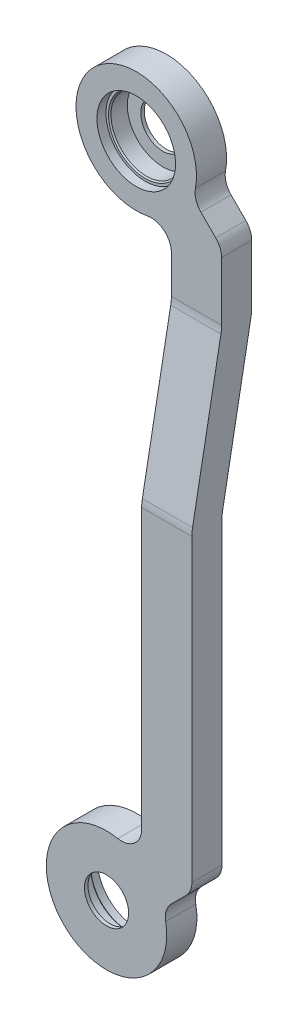
ISO-10303-21;
HEADER;
FILE_DESCRIPTION(('STEP AP214'),'2;1');
FILE_NAME('part.step','',(''),(''),'','','');
FILE_SCHEMA(('AUTOMOTIVE_DESIGN { 1 0 10303 214 1 1 1 1 }'));
ENDSEC;
DATA;
#1=APPLICATION_CONTEXT('core data for automotive mechanical design processes');
#2=APPLICATION_PROTOCOL_DEFINITION('international standard','automotive_design',2000,#1);
#3=PRODUCT_CONTEXT('',#1,'mechanical');
#4=PRODUCT('Part','Part','',(#3));
#5=PRODUCT_RELATED_PRODUCT_CATEGORY('part','',(#4));
#6=PRODUCT_DEFINITION_FORMATION('','',#4);
#7=PRODUCT_DEFINITION_CONTEXT('part definition',#1,'design');
#8=PRODUCT_DEFINITION('design','',#6,#7);
#9=PRODUCT_DEFINITION_SHAPE('','',#8);
#10=(LENGTH_UNIT() NAMED_UNIT(*) SI_UNIT(.MILLI.,.METRE.));
#11=(NAMED_UNIT(*) PLANE_ANGLE_UNIT() SI_UNIT($,.RADIAN.));
#12=(NAMED_UNIT(*) SI_UNIT($,.STERADIAN.) SOLID_ANGLE_UNIT());
#13=UNCERTAINTY_MEASURE_WITH_UNIT(LENGTH_MEASURE(1.E-05),#10,'distance_accuracy_value','');
#14=(GEOMETRIC_REPRESENTATION_CONTEXT(3) GLOBAL_UNCERTAINTY_ASSIGNED_CONTEXT((#13)) GLOBAL_UNIT_ASSIGNED_CONTEXT((#10,
#11,#12)) REPRESENTATION_CONTEXT('',''));
#15=CARTESIAN_POINT('',(0.,0.,0.));
#16=DIRECTION('',(0.,0.,1.));
#17=DIRECTION('',(1.,0.,0.));
#18=AXIS2_PLACEMENT_3D('',#15,#16,#17);
#19=CARTESIAN_POINT('',(0.,203.2,9.52499999999999));
#20=DIRECTION('',(0.,0.,1.));
#21=DIRECTION('',(1.,0.,0.));
#22=AXIS2_PLACEMENT_3D('',#19,#20,#21);
#23=CYLINDRICAL_SURFACE('',#22,6.985);
#24=CARTESIAN_POINT('',(0.,203.2,-9.39799999999998));
#25=DIRECTION('',(0.,0.,1.));
#26=DIRECTION('',(1.,0.,0.));
#27=AXIS2_PLACEMENT_3D('',#24,#25,#26);
#28=CIRCLE('',#27,6.985);
#29=CARTESIAN_POINT('',(6.985,203.2,-9.39799999999998));
#30=VERTEX_POINT('',#29);
#31=EDGE_CURVE('E506',#30,#30,#28,.T.);
#32=ORIENTED_EDGE('',*,*,#31,.F.);
#33=EDGE_LOOP('',(#32));
#34=FACE_BOUND('',#33,.T.);
#35=CARTESIAN_POINT('',(0.,203.2,-8.28674999999995));
#36=DIRECTION('',(0.,0.,1.));
#37=DIRECTION('',(1.,0.,0.));
#38=AXIS2_PLACEMENT_3D('',#35,#36,#37);
#39=CIRCLE('',#38,6.985);
#40=CARTESIAN_POINT('',(6.985,203.2,-8.28674999999995));
#41=VERTEX_POINT('',#40);
#42=EDGE_CURVE('E441',#41,#41,#39,.F.);
#43=ORIENTED_EDGE('',*,*,#42,.F.);
#44=EDGE_LOOP('',(#43));
#45=FACE_BOUND('',#44,.T.);
#46=ADVANCED_FACE('F44',(#34,#45),#23,.F.);
#47=CARTESIAN_POINT('',(0.,0.,9.52499999999999));
#48=DIRECTION('',(0.,0.,1.));
#49=DIRECTION('',(1.,0.,0.));
#50=AXIS2_PLACEMENT_3D('',#47,#48,#49);
#51=CYLINDRICAL_SURFACE('',#50,6.985);
#52=CARTESIAN_POINT('',(0.,0.,9.52499999999999));
#53=DIRECTION('',(0.,0.,1.));
#54=DIRECTION('',(1.,0.,0.));
#55=AXIS2_PLACEMENT_3D('',#52,#53,#54);
#56=CIRCLE('',#55,6.985);
#57=CARTESIAN_POINT('',(6.985,0.,9.52499999999999));
#58=VERTEX_POINT('',#57);
#59=EDGE_CURVE('E445',#58,#58,#56,.T.);
#60=ORIENTED_EDGE('',*,*,#59,.T.);
#61=EDGE_LOOP('',(#60));
#62=FACE_BOUND('',#61,.T.);
#63=CARTESIAN_POINT('',(0.,0.,8.41375));
#64=DIRECTION('',(0.,0.,-1.));
#65=DIRECTION('',(-1.,0.,0.));
#66=AXIS2_PLACEMENT_3D('',#63,#64,#65);
#67=CIRCLE('',#66,6.985);
#68=CARTESIAN_POINT('',(-6.985,0.,8.41375));
#69=VERTEX_POINT('',#68);
#70=EDGE_CURVE('E437',#69,#69,#67,.F.);
#71=ORIENTED_EDGE('',*,*,#70,.F.);
#72=EDGE_LOOP('',(#71));
#73=FACE_BOUND('',#72,.T.);
#74=ADVANCED_FACE('F626',(#62,#73),#51,.F.);
#75=CARTESIAN_POINT('',(0.,203.2,63.5));
#76=DIRECTION('',(0.,0.,-1.));
#77=DIRECTION('',(-1.,0.,0.));
#78=AXIS2_PLACEMENT_3D('',#75,#76,#77);
#79=CYLINDRICAL_SURFACE('',#78,19.05);
#80=CARTESIAN_POINT('',(0.,203.2,-9.39799999999996));
#81=DIRECTION('',(0.,0.,-1.));
#82=DIRECTION('',(0.,1.,0.));
#83=AXIS2_PLACEMENT_3D('',#80,#81,#82);
#84=CIRCLE('',#83,19.05);
#85=CARTESIAN_POINT('',(3.56018596316735,184.485631832529,-9.39799999999997));
#86=VERTEX_POINT('',#85);
#87=CARTESIAN_POINT('',(18.7143681674714,199.639814036833,-9.39799999999996));
#88=VERTEX_POINT('',#87);
#89=EDGE_CURVE('E374',#86,#88,#84,.T.);
#90=ORIENTED_EDGE('',*,*,#89,.F.);
#91=DIRECTION('',(0.,0.,-1.));
#92=VECTOR('',#91,1.);
#93=CARTESIAN_POINT('',(3.56018596316735,184.485631832529,63.5));
#94=LINE('',#93,#92);
#95=CARTESIAN_POINT('',(3.56018596316735,184.485631832529,0.127000000000044));
#96=VERTEX_POINT('',#95);
#97=EDGE_CURVE('E305',#86,#96,#94,.F.);
#98=ORIENTED_EDGE('',*,*,#97,.T.);
#99=CARTESIAN_POINT('',(0.,203.2,0.127000000000044));
#100=DIRECTION('',(0.,0.,1.));
#101=DIRECTION('',(1.,0.,0.));
#102=AXIS2_PLACEMENT_3D('',#99,#100,#101);
#103=CIRCLE('',#102,19.05);
#104=CARTESIAN_POINT('',(18.7143681674714,199.639814036833,0.127000000000044));
#105=VERTEX_POINT('',#104);
#106=EDGE_CURVE('E359',#105,#96,#103,.T.);
#107=ORIENTED_EDGE('',*,*,#106,.F.);
#108=DIRECTION('',(0.,0.,-1.));
#109=VECTOR('',#108,1.);
#110=CARTESIAN_POINT('',(18.7143681674714,199.639814036833,63.5));
#111=LINE('',#110,#109);
#112=EDGE_CURVE('E301',#105,#88,#111,.T.);
#113=ORIENTED_EDGE('',*,*,#112,.T.);
#114=EDGE_LOOP('',(#90,#98,#107,#113));
#115=FACE_BOUND('',#114,.T.);
#116=ADVANCED_FACE('F377',(#115),#79,.T.);
#117=CARTESIAN_POINT('',(6.63271851688673,185.341961331777,63.5));
#118=DIRECTION('',(0.707106781186544,0.707106781186551,0.));
#119=DIRECTION('',(-0.707106781186551,0.707106781186544,0.));
#120=AXIS2_PLACEMENT_3D('',#117,#118,#119);
#121=PLANE('',#120);
#122=DIRECTION('',(-0.707106781186551,0.707106781186544,0.));
#123=VECTOR('',#122,1.);
#124=CARTESIAN_POINT('',(6.63271851688672,185.341961331777,-9.39799999999998));
#125=LINE('',#124,#123);
#126=CARTESIAN_POINT('',(9.25262806053454,182.722051788129,-9.39799999999998));
#127=VERTEX_POINT('',#126);
#128=CARTESIAN_POINT('',(9.23704267809101,182.737637170573,-9.39799999999998));
#129=VERTEX_POINT('',#128);
#130=EDGE_CURVE('E375',#127,#129,#125,.T.);
#131=ORIENTED_EDGE('',*,*,#130,.F.);
#132=DIRECTION('',(0.,0.,-1.));
#133=VECTOR('',#132,1.);
#134=CARTESIAN_POINT('',(9.25262806053455,182.722051788129,0.127000000000044));
#135=LINE('',#134,#133);
#136=CARTESIAN_POINT('',(9.25262806053455,182.722051788129,0.127000000000044));
#137=VERTEX_POINT('',#136);
#138=EDGE_CURVE('E298',#127,#137,#135,.F.);
#139=ORIENTED_EDGE('',*,*,#138,.T.);
#140=DIRECTION('',(0.707106781186551,-0.707106781186544,0.));
#141=VECTOR('',#140,1.);
#142=CARTESIAN_POINT('',(6.63271851688673,185.341961331777,0.127000000000044));
#143=LINE('',#142,#141);
#144=CARTESIAN_POINT('',(9.23704267809101,182.737637170573,0.127000000000044));
#145=VERTEX_POINT('',#144);
#146=EDGE_CURVE('E356',#145,#137,#143,.T.);
#147=ORIENTED_EDGE('',*,*,#146,.F.);
#148=DIRECTION('',(0.,0.,1.));
#149=VECTOR('',#148,1.);
#150=CARTESIAN_POINT('',(9.23704267809101,182.737637170573,-9.39799999999996));
#151=LINE('',#150,#149);
#152=EDGE_CURVE('E294',#145,#129,#151,.F.);
#153=ORIENTED_EDGE('',*,*,#152,.T.);
#154=EDGE_LOOP('',(#131,#139,#147,#153));
#155=FACE_BOUND('',#154,.T.);
#156=ADVANCED_FACE('F365',(#155),#121,.F.);
#157=CARTESIAN_POINT('',(11.1125,180.862179848664,63.5));
#158=DIRECTION('',(1.,0.,0.));
#159=DIRECTION('',(0.,1.,0.));
#160=AXIS2_PLACEMENT_3D('',#157,#158,#159);
#161=PLANE('',#160);
#162=DIRECTION('',(0.,1.,0.));
#163=VECTOR('',#162,1.);
#164=CARTESIAN_POINT('',(11.1125,180.862179848664,0.));
#165=LINE('',#164,#163);
#166=CARTESIAN_POINT('',(11.1125,24.9680762724054,0.));
#167=VERTEX_POINT('',#166);
#168=CARTESIAN_POINT('',(11.1125,113.135133042531,0.));
#169=VERTEX_POINT('',#168);
#170=EDGE_CURVE('E233',#167,#169,#165,.T.);
#171=ORIENTED_EDGE('',*,*,#170,.F.);
#172=DIRECTION('',(0.,0.,-1.));
#173=VECTOR('',#172,1.);
#174=CARTESIAN_POINT('',(11.1125,24.9680762724054,9.52499999999999));
#175=LINE('',#174,#173);
#176=CARTESIAN_POINT('',(11.1125,24.9680762724054,9.525));
#177=VERTEX_POINT('',#176);
#178=EDGE_CURVE('E291',#167,#177,#175,.F.);
#179=ORIENTED_EDGE('',*,*,#178,.T.);
#180=DIRECTION('',(0.,-1.,0.));
#181=VECTOR('',#180,1.);
#182=CARTESIAN_POINT('',(11.1125,180.862179848664,9.52500000000003));
#183=LINE('',#182,#181);
#184=CARTESIAN_POINT('',(11.1125,113.135133042531,9.52500000000002));
#185=VERTEX_POINT('',#184);
#186=EDGE_CURVE('E427',#185,#177,#183,.T.);
#187=ORIENTED_EDGE('',*,*,#186,.F.);
#188=CARTESIAN_POINT('',(11.1125,113.135133042531,-3.17499999999998));
#189=DIRECTION('',(1.,0.,0.));
#190=DIRECTION('',(0.,1.,0.));
#191=AXIS2_PLACEMENT_3D('',#188,#189,#190);
#192=CIRCLE('',#191,12.7);
#193=CARTESIAN_POINT('',(11.1125,115.445430677591,9.31309532464575));
#194=VERTEX_POINT('',#193);
#195=EDGE_CURVE('E458',#185,#194,#192,.F.);
#196=ORIENTED_EDGE('',*,*,#195,.T.);
#197=DIRECTION('',(0.,-0.98331459249179,0.181913199610981));
#198=VECTOR('',#197,1.);
#199=CARTESIAN_POINT('',(11.1125,169.004541902066,-0.595340251882098));
#200=LINE('',#199,#198);
#201=CARTESIAN_POINT('',(11.1125,163.954569322409,0.338904675354306));
#202=VERTEX_POINT('',#201);
#203=EDGE_CURVE('E232',#202,#194,#200,.T.);
#204=ORIENTED_EDGE('',*,*,#203,.F.);
#205=CARTESIAN_POINT('',(11.1125,166.264866957469,12.827));
#206=DIRECTION('',(1.,0.,0.));
#207=DIRECTION('',(0.,1.,0.));
#208=AXIS2_PLACEMENT_3D('',#205,#206,#207);
#209=CIRCLE('',#208,12.7);
#210=CARTESIAN_POINT('',(11.1125,166.264866957469,0.127000000000044));
#211=VERTEX_POINT('',#210);
#212=EDGE_CURVE('E244',#202,#211,#209,.T.);
#213=ORIENTED_EDGE('',*,*,#212,.T.);
#214=DIRECTION('',(0.,-1.,0.));
#215=VECTOR('',#214,1.);
#216=CARTESIAN_POINT('',(11.1125,180.862179848664,0.127000000000044));
#217=LINE('',#216,#215);
#218=CARTESIAN_POINT('',(11.1125,178.231923727595,0.127000000000044));
#219=VERTEX_POINT('',#218);
#220=EDGE_CURVE('E369',#219,#211,#217,.T.);
#221=ORIENTED_EDGE('',*,*,#220,.F.);
#222=DIRECTION('',(0.,0.,-1.));
#223=VECTOR('',#222,1.);
#224=CARTESIAN_POINT('',(11.1125,178.231923727595,-9.39799999999998));
#225=LINE('',#224,#223);
#226=CARTESIAN_POINT('',(11.1125,178.231923727595,-9.39799999999998));
#227=VERTEX_POINT('',#226);
#228=EDGE_CURVE('E287',#219,#227,#225,.T.);
#229=ORIENTED_EDGE('',*,*,#228,.T.);
#230=DIRECTION('',(0.,1.,0.));
#231=VECTOR('',#230,1.);
#232=CARTESIAN_POINT('',(11.1125,180.862179848664,-9.39799999999998));
#233=LINE('',#232,#231);
#234=CARTESIAN_POINT('',(11.1125,166.264866957469,-9.39799999999998));
#235=VERTEX_POINT('',#234);
#236=EDGE_CURVE('E384',#235,#227,#233,.T.);
#237=ORIENTED_EDGE('',*,*,#236,.F.);
#238=CARTESIAN_POINT('',(11.1125,166.264866957469,3.30200000000003));
#239=DIRECTION('',(1.,0.,0.));
#240=DIRECTION('',(0.,1.,0.));
#241=AXIS2_PLACEMENT_3D('',#238,#239,#240);
#242=CIRCLE('',#241,12.7);
#243=CARTESIAN_POINT('',(11.1125,163.954569322409,-9.1860953246457));
#244=VERTEX_POINT('',#243);
#245=EDGE_CURVE('E230',#235,#244,#242,.F.);
#246=ORIENTED_EDGE('',*,*,#245,.T.);
#247=DIRECTION('',(0.,0.98331459249179,-0.181913199610981));
#248=VECTOR('',#247,1.);
#249=CARTESIAN_POINT('',(11.1125,167.300729868901,-9.80513502574659));
#250=LINE('',#249,#248);
#251=CARTESIAN_POINT('',(11.1125,115.445430677591,-0.211904675354252));
#252=VERTEX_POINT('',#251);
#253=EDGE_CURVE('E211',#252,#244,#250,.T.);
#254=ORIENTED_EDGE('',*,*,#253,.F.);
#255=CARTESIAN_POINT('',(11.1125,113.135133042531,-12.7));
#256=DIRECTION('',(1.,0.,0.));
#257=DIRECTION('',(0.,1.,0.));
#258=AXIS2_PLACEMENT_3D('',#255,#256,#257);
#259=CIRCLE('',#258,12.7);
#260=EDGE_CURVE('E226',#252,#169,#259,.T.);
#261=ORIENTED_EDGE('',*,*,#260,.T.);
#262=EDGE_LOOP('',(#171,#179,#187,#196,#204,#213,#221,#229,#237,#246,#254,#261));
#263=FACE_BOUND('',#262,.T.);
#264=ADVANCED_FACE('F225',(#263),#161,.F.);
#265=CARTESIAN_POINT('',(11.1125,22.3378201513362,63.5));
#266=DIRECTION('',(0.707106781186543,-0.707106781186552,0.));
#267=DIRECTION('',(0.707106781186552,0.707106781186543,0.));
#268=AXIS2_PLACEMENT_3D('',#265,#266,#267);
#269=PLANE('',#268);
#270=DIRECTION('',(0.707106781186552,0.707106781186543,0.));
#271=VECTOR('',#270,1.);
#272=CARTESIAN_POINT('',(11.1125,22.3378201513362,0.));
#273=LINE('',#272,#271);
#274=CARTESIAN_POINT('',(9.23704267809101,20.4623628294272,0.));
#275=VERTEX_POINT('',#274);
#276=CARTESIAN_POINT('',(9.25262806053457,20.4779482118708,0.));
#277=VERTEX_POINT('',#276);
#278=EDGE_CURVE('E406',#275,#277,#273,.T.);
#279=ORIENTED_EDGE('',*,*,#278,.F.);
#280=DIRECTION('',(0.,0.,1.));
#281=VECTOR('',#280,1.);
#282=CARTESIAN_POINT('',(9.23704267809101,20.4623628294272,9.525));
#283=LINE('',#282,#281);
#284=CARTESIAN_POINT('',(9.23704267809101,20.4623628294272,9.52499999999999));
#285=VERTEX_POINT('',#284);
#286=EDGE_CURVE('E284',#275,#285,#283,.T.);
#287=ORIENTED_EDGE('',*,*,#286,.T.);
#288=DIRECTION('',(-0.707106781186552,-0.707106781186543,0.));
#289=VECTOR('',#288,1.);
#290=CARTESIAN_POINT('',(11.1125,22.3378201513362,9.52499999999999));
#291=LINE('',#290,#289);
#292=CARTESIAN_POINT('',(9.25262806053457,20.4779482118708,9.52499999999999));
#293=VERTEX_POINT('',#292);
#294=EDGE_CURVE('E423',#293,#285,#291,.T.);
#295=ORIENTED_EDGE('',*,*,#294,.F.);
#296=DIRECTION('',(0.,0.,-1.));
#297=VECTOR('',#296,1.);
#298=CARTESIAN_POINT('',(9.25262806053457,20.4779482118708,0.));
#299=LINE('',#298,#297);
#300=EDGE_CURVE('E280',#293,#277,#299,.T.);
#301=ORIENTED_EDGE('',*,*,#300,.T.);
#302=EDGE_LOOP('',(#279,#287,#295,#301));
#303=FACE_BOUND('',#302,.T.);
#304=ADVANCED_FACE('F595',(#303),#269,.F.);
#305=CARTESIAN_POINT('',(0.,0.,63.5));
#306=DIRECTION('',(0.,0.,-1.));
#307=DIRECTION('',(-1.,0.,0.));
#308=AXIS2_PLACEMENT_3D('',#305,#306,#307);
#309=CYLINDRICAL_SURFACE('',#308,19.05);
#310=CARTESIAN_POINT('',(0.,0.,0.));
#311=DIRECTION('',(0.,0.,-1.));
#312=DIRECTION('',(-1.,0.,0.));
#313=AXIS2_PLACEMENT_3D('',#310,#311,#312);
#314=CIRCLE('',#313,19.05);
#315=CARTESIAN_POINT('',(18.7143681674714,3.56018596316709,0.));
#316=VERTEX_POINT('',#315);
#317=CARTESIAN_POINT('',(3.56018596316735,18.7143681674714,0.));
#318=VERTEX_POINT('',#317);
#319=EDGE_CURVE('E402',#316,#318,#314,.T.);
#320=ORIENTED_EDGE('',*,*,#319,.F.);
#321=DIRECTION('',(0.,0.,-1.));
#322=VECTOR('',#321,1.);
#323=CARTESIAN_POINT('',(18.7143681674714,3.56018596316709,63.5));
#324=LINE('',#323,#322);
#325=CARTESIAN_POINT('',(18.7143681674714,3.56018596316709,9.52499999999999));
#326=VERTEX_POINT('',#325);
#327=EDGE_CURVE('E277',#316,#326,#324,.F.);
#328=ORIENTED_EDGE('',*,*,#327,.T.);
#329=CARTESIAN_POINT('',(0.,0.,9.52499999999999));
#330=DIRECTION('',(0.,0.,1.));
#331=DIRECTION('',(0.,-1.,0.));
#332=AXIS2_PLACEMENT_3D('',#329,#330,#331);
#333=CIRCLE('',#332,19.05);
#334=CARTESIAN_POINT('',(3.56018596316735,18.7143681674714,9.525));
#335=VERTEX_POINT('',#334);
#336=EDGE_CURVE('E419',#335,#326,#333,.T.);
#337=ORIENTED_EDGE('',*,*,#336,.F.);
#338=DIRECTION('',(0.,0.,-1.));
#339=VECTOR('',#338,1.);
#340=CARTESIAN_POINT('',(3.56018596316735,18.7143681674714,63.5));
#341=LINE('',#340,#339);
#342=EDGE_CURVE('E273',#335,#318,#341,.T.);
#343=ORIENTED_EDGE('',*,*,#342,.T.);
#344=EDGE_LOOP('',(#320,#328,#337,#343));
#345=FACE_BOUND('',#344,.T.);
#346=ADVANCED_FACE('F587',(#345),#309,.T.);
#347=CARTESIAN_POINT('',(26.9875,15.7621798486633,63.5));
#348=DIRECTION('',(-0.707106781186543,0.707106781186552,0.));
#349=DIRECTION('',(-0.707106781186552,-0.707106781186543,0.));
#350=AXIS2_PLACEMENT_3D('',#347,#348,#349);
#351=PLANE('',#350);
#352=DIRECTION('',(-0.707106781186552,-0.707106781186543,0.));
#353=VECTOR('',#352,1.);
#354=CARTESIAN_POINT('',(26.9875,15.7621798486633,0.));
#355=LINE('',#354,#353);
#356=CARTESIAN_POINT('',(25.1276280605346,13.9023079091978,0.));
#357=VERTEX_POINT('',#356);
#358=CARTESIAN_POINT('',(20.4623628294274,9.23704267809072,0.));
#359=VERTEX_POINT('',#358);
#360=EDGE_CURVE('E398',#357,#359,#355,.T.);
#361=ORIENTED_EDGE('',*,*,#360,.F.);
#362=DIRECTION('',(0.,0.,-1.));
#363=VECTOR('',#362,1.);
#364=CARTESIAN_POINT('',(25.1276280605346,13.9023079091978,63.5));
#365=LINE('',#364,#363);
#366=CARTESIAN_POINT('',(25.1276280605346,13.9023079091978,9.52499999999999));
#367=VERTEX_POINT('',#366);
#368=EDGE_CURVE('E267',#357,#367,#365,.F.);
#369=ORIENTED_EDGE('',*,*,#368,.T.);
#370=DIRECTION('',(0.707106781186552,0.707106781186543,0.));
#371=VECTOR('',#370,1.);
#372=CARTESIAN_POINT('',(26.9875,15.7621798486633,9.52499999999999));
#373=LINE('',#372,#371);
#374=CARTESIAN_POINT('',(20.4623628294274,9.23704267809072,9.52499999999999));
#375=VERTEX_POINT('',#374);
#376=EDGE_CURVE('E415',#375,#367,#373,.T.);
#377=ORIENTED_EDGE('',*,*,#376,.F.);
#378=DIRECTION('',(0.,0.,1.));
#379=VECTOR('',#378,1.);
#380=CARTESIAN_POINT('',(20.4623628294274,9.23704267809072,0.));
#381=LINE('',#380,#379);
#382=EDGE_CURVE('E263',#375,#359,#381,.F.);
#383=ORIENTED_EDGE('',*,*,#382,.T.);
#384=EDGE_LOOP('',(#361,#369,#377,#383));
#385=FACE_BOUND('',#384,.T.);
#386=ADVANCED_FACE('F576',(#385),#351,.F.);
#387=CARTESIAN_POINT('',(26.9875,15.7621798486633,63.5));
#388=DIRECTION('',(-1.,0.,0.));
#389=DIRECTION('',(0.,-1.,0.));
#390=AXIS2_PLACEMENT_3D('',#387,#388,#389);
#391=PLANE('',#390);
#392=DIRECTION('',(0.,-1.,0.));
#393=VECTOR('',#392,1.);
#394=CARTESIAN_POINT('',(26.9875,-19.05,9.52499999999998));
#395=LINE('',#394,#393);
#396=CARTESIAN_POINT('',(26.9875,113.135133042531,9.52500000000002));
#397=VERTEX_POINT('',#396);
#398=CARTESIAN_POINT('',(26.9875,18.3924359697325,9.52499999999999));
#399=VERTEX_POINT('',#398);
#400=EDGE_CURVE('E380',#397,#399,#395,.T.);
#401=ORIENTED_EDGE('',*,*,#400,.T.);
#402=DIRECTION('',(0.,0.,-1.));
#403=VECTOR('',#402,1.);
#404=CARTESIAN_POINT('',(26.9875,18.3924359697325,63.5));
#405=LINE('',#404,#403);
#406=CARTESIAN_POINT('',(26.9875,18.3924359697325,0.));
#407=VERTEX_POINT('',#406);
#408=EDGE_CURVE('E256',#399,#407,#405,.T.);
#409=ORIENTED_EDGE('',*,*,#408,.T.);
#410=DIRECTION('',(0.,1.,0.));
#411=VECTOR('',#410,1.);
#412=CARTESIAN_POINT('',(26.9875,114.3,0.));
#413=LINE('',#412,#411);
#414=CARTESIAN_POINT('',(26.9875,113.135133042531,0.));
#415=VERTEX_POINT('',#414);
#416=EDGE_CURVE('E503',#407,#415,#413,.T.);
#417=ORIENTED_EDGE('',*,*,#416,.T.);
#418=CARTESIAN_POINT('',(26.9875,113.135133042531,-12.7));
#419=DIRECTION('',(-1.,0.,0.));
#420=DIRECTION('',(0.,-1.,0.));
#421=AXIS2_PLACEMENT_3D('',#418,#419,#420);
#422=CIRCLE('',#421,12.7);
#423=CARTESIAN_POINT('',(26.9875,115.445430677591,-0.211904675354257));
#424=VERTEX_POINT('',#423);
#425=EDGE_CURVE('E240',#415,#424,#422,.T.);
#426=ORIENTED_EDGE('',*,*,#425,.T.);
#427=DIRECTION('',(0.,0.98331459249179,-0.181913199610981));
#428=VECTOR('',#427,1.);
#429=CARTESIAN_POINT('',(26.9875,165.1,-9.39799999999997));
#430=LINE('',#429,#428);
#431=CARTESIAN_POINT('',(26.9875,163.954569322409,-9.18609532464571));
#432=VERTEX_POINT('',#431);
#433=EDGE_CURVE('E214',#424,#432,#430,.T.);
#434=ORIENTED_EDGE('',*,*,#433,.T.);
#435=CARTESIAN_POINT('',(26.9875,166.264866957469,3.30200000000003));
#436=DIRECTION('',(-1.,0.,0.));
#437=DIRECTION('',(0.,-1.,0.));
#438=AXIS2_PLACEMENT_3D('',#435,#436,#437);
#439=CIRCLE('',#438,12.7);
#440=CARTESIAN_POINT('',(26.9875,166.264866957469,-9.39799999999997));
#441=VERTEX_POINT('',#440);
#442=EDGE_CURVE('E452',#432,#441,#439,.F.);
#443=ORIENTED_EDGE('',*,*,#442,.T.);
#444=DIRECTION('',(0.,1.,0.));
#445=VECTOR('',#444,1.);
#446=CARTESIAN_POINT('',(26.9875,222.25,-9.39799999999996));
#447=LINE('',#446,#445);
#448=CARTESIAN_POINT('',(26.9875,184.807564030268,-9.39799999999997));
#449=VERTEX_POINT('',#448);
#450=EDGE_CURVE('E495',#441,#449,#447,.T.);
#451=ORIENTED_EDGE('',*,*,#450,.T.);
#452=DIRECTION('',(0.,0.,-1.));
#453=VECTOR('',#452,1.);
#454=CARTESIAN_POINT('',(26.9875,184.807564030268,63.5));
#455=LINE('',#454,#453);
#456=CARTESIAN_POINT('',(26.9875,184.807564030268,0.127000000000042));
#457=VERTEX_POINT('',#456);
#458=EDGE_CURVE('E253',#449,#457,#455,.F.);
#459=ORIENTED_EDGE('',*,*,#458,.T.);
#460=DIRECTION('',(0.,-1.,0.));
#461=VECTOR('',#460,1.);
#462=CARTESIAN_POINT('',(26.9875,165.1,0.127000000000042));
#463=LINE('',#462,#461);
#464=CARTESIAN_POINT('',(26.9875,166.264866957469,0.127000000000042));
#465=VERTEX_POINT('',#464);
#466=EDGE_CURVE('E477',#457,#465,#463,.T.);
#467=ORIENTED_EDGE('',*,*,#466,.T.);
#468=CARTESIAN_POINT('',(26.9875,166.264866957469,12.827));
#469=DIRECTION('',(-1.,0.,0.));
#470=DIRECTION('',(0.,-1.,0.));
#471=AXIS2_PLACEMENT_3D('',#468,#469,#470);
#472=CIRCLE('',#471,12.7);
#473=CARTESIAN_POINT('',(26.9875,163.954569322409,0.338904675354305));
#474=VERTEX_POINT('',#473);
#475=EDGE_CURVE('E239',#465,#474,#472,.T.);
#476=ORIENTED_EDGE('',*,*,#475,.T.);
#477=DIRECTION('',(0.,-0.98331459249179,0.181913199610981));
#478=VECTOR('',#477,1.);
#479=CARTESIAN_POINT('',(26.9875,114.3,9.52500000000002));
#480=LINE('',#479,#478);
#481=CARTESIAN_POINT('',(26.9875,115.445430677591,9.31309532464575));
#482=VERTEX_POINT('',#481);
#483=EDGE_CURVE('E387',#474,#482,#480,.T.);
#484=ORIENTED_EDGE('',*,*,#483,.T.);
#485=CARTESIAN_POINT('',(26.9875,113.135133042531,-3.17499999999998));
#486=DIRECTION('',(-1.,0.,0.));
#487=DIRECTION('',(0.,-1.,0.));
#488=AXIS2_PLACEMENT_3D('',#485,#486,#487);
#489=CIRCLE('',#488,12.7);
#490=EDGE_CURVE('E449',#482,#397,#489,.F.);
#491=ORIENTED_EDGE('',*,*,#490,.T.);
#492=EDGE_LOOP('',(#401,#409,#417,#426,#434,#443,#451,#459,#467,#476,#484,#491));
#493=FACE_BOUND('',#492,.T.);
#494=ADVANCED_FACE('F488',(#493),#391,.F.);
#495=CARTESIAN_POINT('',(17.8580386682231,196.567281483113,63.5));
#496=DIRECTION('',(-0.707106781186542,-0.707106781186554,0.));
#497=DIRECTION('',(0.707106781186554,-0.707106781186542,0.));
#498=AXIS2_PLACEMENT_3D('',#495,#496,#497);
#499=PLANE('',#498);
#500=DIRECTION('',(0.707106781186554,-0.707106781186542,0.));
#501=VECTOR('',#500,1.);
#502=CARTESIAN_POINT('',(17.8580386682231,196.567281483113,-9.39799999999996));
#503=LINE('',#502,#501);
#504=CARTESIAN_POINT('',(20.4623628294274,193.962957321909,-9.39799999999996));
#505=VERTEX_POINT('',#504);
#506=CARTESIAN_POINT('',(25.1276280605345,189.297692090802,-9.39799999999996));
#507=VERTEX_POINT('',#506);
#508=EDGE_CURVE('E431',#505,#507,#503,.T.);
#509=ORIENTED_EDGE('',*,*,#508,.F.);
#510=DIRECTION('',(0.,0.,1.));
#511=VECTOR('',#510,1.);
#512=CARTESIAN_POINT('',(20.4623628294274,193.962957321909,0.127000000000044));
#513=LINE('',#512,#511);
#514=CARTESIAN_POINT('',(20.4623628294274,193.962957321909,0.127000000000044));
#515=VERTEX_POINT('',#514);
#516=EDGE_CURVE('E311',#505,#515,#513,.T.);
#517=ORIENTED_EDGE('',*,*,#516,.T.);
#518=DIRECTION('',(-0.707106781186554,0.707106781186542,0.));
#519=VECTOR('',#518,1.);
#520=CARTESIAN_POINT('',(17.8580386682231,196.567281483113,0.127000000000044));
#521=LINE('',#520,#519);
#522=CARTESIAN_POINT('',(25.1276280605345,189.297692090802,0.127000000000044));
#523=VERTEX_POINT('',#522);
#524=EDGE_CURVE('E220',#523,#515,#521,.T.);
#525=ORIENTED_EDGE('',*,*,#524,.F.);
#526=DIRECTION('',(0.,0.,-1.));
#527=VECTOR('',#526,1.);
#528=CARTESIAN_POINT('',(25.1276280605345,189.297692090802,63.5));
#529=LINE('',#528,#527);
#530=EDGE_CURVE('E308',#523,#507,#529,.T.);
#531=ORIENTED_EDGE('',*,*,#530,.T.);
#532=EDGE_LOOP('',(#509,#517,#525,#531));
#533=FACE_BOUND('',#532,.T.);
#534=ADVANCED_FACE('F616',(#533),#499,.F.);
#535=CARTESIAN_POINT('',(-19.05,222.25,-9.39799999999996));
#536=DIRECTION('',(0.,0.,-1.));
#537=DIRECTION('',(0.,1.,0.));
#538=AXIS2_PLACEMENT_3D('',#535,#536,#537);
#539=PLANE('',#538);
#540=ORIENTED_EDGE('',*,*,#31,.T.);
#541=EDGE_LOOP('',(#540));
#542=FACE_BOUND('',#541,.T.);
#543=ORIENTED_EDGE('',*,*,#508,.T.);
#544=CARTESIAN_POINT('',(20.6375,184.807564030268,-9.39799999999998));
#545=DIRECTION('',(0.,0.,-1.));
#546=DIRECTION('',(0.,1.,0.));
#547=AXIS2_PLACEMENT_3D('',#544,#545,#546);
#548=CIRCLE('',#547,6.35);
#549=EDGE_CURVE('E60',#507,#449,#548,.T.);
#550=ORIENTED_EDGE('',*,*,#549,.T.);
#551=ORIENTED_EDGE('',*,*,#450,.F.);
#552=DIRECTION('',(1.,0.,0.));
#553=VECTOR('',#552,1.);
#554=CARTESIAN_POINT('',(-19.05,166.264866957469,-9.39799999999997));
#555=LINE('',#554,#553);
#556=EDGE_CURVE('E455',#441,#235,#555,.F.);
#557=ORIENTED_EDGE('',*,*,#556,.T.);
#558=ORIENTED_EDGE('',*,*,#236,.T.);
#559=CARTESIAN_POINT('',(4.7625,178.231923727595,-9.39799999999998));
#560=DIRECTION('',(0.,0.,-1.));
#561=DIRECTION('',(0.,1.,0.));
#562=AXIS2_PLACEMENT_3D('',#559,#560,#561);
#563=CIRCLE('',#562,6.35);
#564=EDGE_CURVE('E337',#227,#127,#563,.F.);
#565=ORIENTED_EDGE('',*,*,#564,.T.);
#566=ORIENTED_EDGE('',*,*,#130,.T.);
#567=CARTESIAN_POINT('',(4.74691461755646,178.247509110038,-9.39799999999998));
#568=DIRECTION('',(0.,0.,-1.));
#569=DIRECTION('',(0.,1.,0.));
#570=AXIS2_PLACEMENT_3D('',#567,#568,#569);
#571=CIRCLE('',#570,6.35);
#572=EDGE_CURVE('E343',#129,#86,#571,.F.);
#573=ORIENTED_EDGE('',*,*,#572,.T.);
#574=ORIENTED_EDGE('',*,*,#89,.T.);
#575=CARTESIAN_POINT('',(24.9524908899619,198.453085382444,-9.39799999999996));
#576=DIRECTION('',(0.,0.,-1.));
#577=DIRECTION('',(0.,1.,0.));
#578=AXIS2_PLACEMENT_3D('',#575,#576,#577);
#579=CIRCLE('',#578,6.35);
#580=EDGE_CURVE('E53',#88,#505,#579,.F.);
#581=ORIENTED_EDGE('',*,*,#580,.T.);
#582=EDGE_LOOP('',(#543,#550,#551,#557,#558,#565,#566,#573,#574,#581));
#583=FACE_BOUND('',#582,.T.);
#584=ADVANCED_FACE('F373',(#542,#583),#539,.T.);
#585=CARTESIAN_POINT('',(-19.05,114.3,0.));
#586=DIRECTION('',(0.,0.,-1.));
#587=DIRECTION('',(-1.,0.,0.));
#588=AXIS2_PLACEMENT_3D('',#585,#586,#587);
#589=PLANE('',#588);
#590=CARTESIAN_POINT('',(0.,0.,0.));
#591=DIRECTION('',(0.,0.,-1.));
#592=DIRECTION('',(0.,1.,0.));
#593=AXIS2_PLACEMENT_3D('',#590,#591,#592);
#594=CIRCLE('',#593,12.430125);
#595=CARTESIAN_POINT('',(0.,12.430125,0.));
#596=VERTEX_POINT('',#595);
#597=EDGE_CURVE('E517',#596,#596,#594,.T.);
#598=ORIENTED_EDGE('',*,*,#597,.F.);
#599=EDGE_LOOP('',(#598));
#600=FACE_BOUND('',#599,.T.);
#601=ORIENTED_EDGE('',*,*,#416,.F.);
#602=CARTESIAN_POINT('',(20.6375,18.3924359697325,0.));
#603=DIRECTION('',(0.,0.,-1.));
#604=DIRECTION('',(-1.,0.,0.));
#605=AXIS2_PLACEMENT_3D('',#602,#603,#604);
#606=CIRCLE('',#605,6.35);
#607=EDGE_CURVE('E260',#407,#357,#606,.T.);
#608=ORIENTED_EDGE('',*,*,#607,.T.);
#609=ORIENTED_EDGE('',*,*,#360,.T.);
#610=CARTESIAN_POINT('',(24.9524908899619,4.74691461755611,0.));
#611=DIRECTION('',(0.,0.,-1.));
#612=DIRECTION('',(-1.,0.,0.));
#613=AXIS2_PLACEMENT_3D('',#610,#611,#612);
#614=CIRCLE('',#613,6.35);
#615=EDGE_CURVE('E319',#359,#316,#614,.F.);
#616=ORIENTED_EDGE('',*,*,#615,.T.);
#617=ORIENTED_EDGE('',*,*,#319,.T.);
#618=CARTESIAN_POINT('',(4.74691461755647,24.9524908899618,0.));
#619=DIRECTION('',(0.,0.,-1.));
#620=DIRECTION('',(-1.,0.,0.));
#621=AXIS2_PLACEMENT_3D('',#618,#619,#620);
#622=CIRCLE('',#621,6.35);
#623=EDGE_CURVE('E325',#318,#275,#622,.F.);
#624=ORIENTED_EDGE('',*,*,#623,.T.);
#625=ORIENTED_EDGE('',*,*,#278,.T.);
#626=CARTESIAN_POINT('',(4.76250000000002,24.9680762724054,0.));
#627=DIRECTION('',(0.,0.,-1.));
#628=DIRECTION('',(-1.,0.,0.));
#629=AXIS2_PLACEMENT_3D('',#626,#627,#628);
#630=CIRCLE('',#629,6.35);
#631=EDGE_CURVE('E331',#277,#167,#630,.F.);
#632=ORIENTED_EDGE('',*,*,#631,.T.);
#633=ORIENTED_EDGE('',*,*,#170,.T.);
#634=DIRECTION('',(1.,0.,0.));
#635=VECTOR('',#634,1.);
#636=CARTESIAN_POINT('',(26.9875,113.135133042531,0.));
#637=LINE('',#636,#635);
#638=EDGE_CURVE('E237',#169,#415,#637,.T.);
#639=ORIENTED_EDGE('',*,*,#638,.T.);
#640=EDGE_LOOP('',(#601,#608,#609,#616,#617,#624,#625,#632,#633,#639));
#641=FACE_BOUND('',#640,.T.);
#642=ADVANCED_FACE('F562',(#600,#641),#589,.T.);
#643=CARTESIAN_POINT('',(-19.05,165.1,-9.39799999999997));
#644=DIRECTION('',(0.,-0.181913199610981,-0.98331459249179));
#645=DIRECTION('',(0.,0.98331459249179,-0.181913199610981));
#646=AXIS2_PLACEMENT_3D('',#643,#644,#645);
#647=PLANE('',#646);
#648=ORIENTED_EDGE('',*,*,#253,.T.);
#649=DIRECTION('',(1.,0.,0.));
#650=VECTOR('',#649,1.);
#651=CARTESIAN_POINT('',(-19.05,163.954569322409,-9.18609532464571));
#652=LINE('',#651,#650);
#653=EDGE_CURVE('E219',#244,#432,#652,.T.);
#654=ORIENTED_EDGE('',*,*,#653,.T.);
#655=ORIENTED_EDGE('',*,*,#433,.F.);
#656=DIRECTION('',(1.,0.,0.));
#657=VECTOR('',#656,1.);
#658=CARTESIAN_POINT('',(11.1125,115.445430677591,-0.211904675354261));
#659=LINE('',#658,#657);
#660=EDGE_CURVE('E207',#424,#252,#659,.F.);
#661=ORIENTED_EDGE('',*,*,#660,.T.);
#662=EDGE_LOOP('',(#648,#654,#655,#661));
#663=FACE_BOUND('',#662,.T.);
#664=ADVANCED_FACE('F209',(#663),#647,.T.);
#665=CARTESIAN_POINT('',(-19.05,-19.05,9.52499999999998));
#666=DIRECTION('',(0.,0.,1.));
#667=DIRECTION('',(0.,-1.,0.));
#668=AXIS2_PLACEMENT_3D('',#665,#666,#667);
#669=PLANE('',#668);
#670=ORIENTED_EDGE('',*,*,#59,.F.);
#671=EDGE_LOOP('',(#670));
#672=FACE_BOUND('',#671,.T.);
#673=ORIENTED_EDGE('',*,*,#376,.T.);
#674=CARTESIAN_POINT('',(20.6375,18.3924359697325,9.52499999999999));
#675=DIRECTION('',(0.,0.,1.));
#676=DIRECTION('',(0.,-1.,0.));
#677=AXIS2_PLACEMENT_3D('',#674,#675,#676);
#678=CIRCLE('',#677,6.35);
#679=EDGE_CURVE('E270',#367,#399,#678,.T.);
#680=ORIENTED_EDGE('',*,*,#679,.T.);
#681=ORIENTED_EDGE('',*,*,#400,.F.);
#682=DIRECTION('',(1.,0.,0.));
#683=VECTOR('',#682,1.);
#684=CARTESIAN_POINT('',(-19.05,113.135133042531,9.52500000000002));
#685=LINE('',#684,#683);
#686=EDGE_CURVE('E470',#397,#185,#685,.F.);
#687=ORIENTED_EDGE('',*,*,#686,.T.);
#688=ORIENTED_EDGE('',*,*,#186,.T.);
#689=CARTESIAN_POINT('',(4.76250000000002,24.9680762724054,9.525));
#690=DIRECTION('',(0.,0.,1.));
#691=DIRECTION('',(0.,-1.,0.));
#692=AXIS2_PLACEMENT_3D('',#689,#690,#691);
#693=CIRCLE('',#692,6.35);
#694=EDGE_CURVE('E334',#177,#293,#693,.F.);
#695=ORIENTED_EDGE('',*,*,#694,.T.);
#696=ORIENTED_EDGE('',*,*,#294,.T.);
#697=CARTESIAN_POINT('',(4.74691461755647,24.9524908899618,9.525));
#698=DIRECTION('',(0.,0.,1.));
#699=DIRECTION('',(0.,-1.,0.));
#700=AXIS2_PLACEMENT_3D('',#697,#698,#699);
#701=CIRCLE('',#700,6.35);
#702=EDGE_CURVE('E328',#285,#335,#701,.F.);
#703=ORIENTED_EDGE('',*,*,#702,.T.);
#704=ORIENTED_EDGE('',*,*,#336,.T.);
#705=CARTESIAN_POINT('',(24.9524908899619,4.74691461755611,9.52499999999999));
#706=DIRECTION('',(0.,0.,1.));
#707=DIRECTION('',(0.,-1.,0.));
#708=AXIS2_PLACEMENT_3D('',#705,#706,#707);
#709=CIRCLE('',#708,6.35);
#710=EDGE_CURVE('E322',#326,#375,#709,.F.);
#711=ORIENTED_EDGE('',*,*,#710,.T.);
#712=EDGE_LOOP('',(#673,#680,#681,#687,#688,#695,#696,#703,#704,#711));
#713=FACE_BOUND('',#712,.T.);
#714=ADVANCED_FACE('F579',(#672,#713),#669,.T.);
#715=CARTESIAN_POINT('',(-19.05,114.3,9.52500000000002));
#716=DIRECTION('',(0.,0.181913199610981,0.98331459249179));
#717=DIRECTION('',(0.,-0.98331459249179,0.181913199610981));
#718=AXIS2_PLACEMENT_3D('',#715,#716,#717);
#719=PLANE('',#718);
#720=ORIENTED_EDGE('',*,*,#203,.T.);
#721=DIRECTION('',(1.,0.,0.));
#722=VECTOR('',#721,1.);
#723=CARTESIAN_POINT('',(-19.05,115.445430677591,9.31309532464575));
#724=LINE('',#723,#722);
#725=EDGE_CURVE('E466',#194,#482,#724,.T.);
#726=ORIENTED_EDGE('',*,*,#725,.T.);
#727=ORIENTED_EDGE('',*,*,#483,.F.);
#728=DIRECTION('',(1.,0.,0.));
#729=VECTOR('',#728,1.);
#730=CARTESIAN_POINT('',(11.1125,163.954569322409,0.338904675354305));
#731=LINE('',#730,#729);
#732=EDGE_CURVE('E463',#474,#202,#731,.F.);
#733=ORIENTED_EDGE('',*,*,#732,.T.);
#734=EDGE_LOOP('',(#720,#726,#727,#733));
#735=FACE_BOUND('',#734,.T.);
#736=ADVANCED_FACE('F490',(#735),#719,.T.);
#737=CARTESIAN_POINT('',(-19.05,165.1,0.127000000000042));
#738=DIRECTION('',(0.,0.,1.));
#739=DIRECTION('',(1.,0.,0.));
#740=AXIS2_PLACEMENT_3D('',#737,#738,#739);
#741=PLANE('',#740);
#742=CARTESIAN_POINT('',(0.,203.2,0.127000000000044));
#743=DIRECTION('',(0.,0.,1.));
#744=DIRECTION('',(0.,-1.,0.));
#745=AXIS2_PLACEMENT_3D('',#742,#743,#744);
#746=CIRCLE('',#745,12.430125);
#747=CARTESIAN_POINT('',(0.,190.769875,0.127000000000044));
#748=VERTEX_POINT('',#747);
#749=EDGE_CURVE('E527',#748,#748,#746,.T.);
#750=ORIENTED_EDGE('',*,*,#749,.F.);
#751=EDGE_LOOP('',(#750));
#752=FACE_BOUND('',#751,.T.);
#753=ORIENTED_EDGE('',*,*,#466,.F.);
#754=CARTESIAN_POINT('',(20.6375,184.807564030268,0.127000000000044));
#755=DIRECTION('',(0.,0.,1.));
#756=DIRECTION('',(1.,0.,0.));
#757=AXIS2_PLACEMENT_3D('',#754,#755,#756);
#758=CIRCLE('',#757,6.35);
#759=EDGE_CURVE('E316',#457,#523,#758,.T.);
#760=ORIENTED_EDGE('',*,*,#759,.T.);
#761=ORIENTED_EDGE('',*,*,#524,.T.);
#762=CARTESIAN_POINT('',(24.9524908899619,198.453085382444,0.127000000000044));
#763=DIRECTION('',(0.,0.,1.));
#764=DIRECTION('',(1.,0.,0.));
#765=AXIS2_PLACEMENT_3D('',#762,#763,#764);
#766=CIRCLE('',#765,6.35);
#767=EDGE_CURVE('E12',#515,#105,#766,.F.);
#768=ORIENTED_EDGE('',*,*,#767,.T.);
#769=ORIENTED_EDGE('',*,*,#106,.T.);
#770=CARTESIAN_POINT('',(4.74691461755646,178.247509110038,0.127000000000044));
#771=DIRECTION('',(0.,0.,1.));
#772=DIRECTION('',(1.,0.,0.));
#773=AXIS2_PLACEMENT_3D('',#770,#771,#772);
#774=CIRCLE('',#773,6.35);
#775=EDGE_CURVE('E346',#96,#145,#774,.F.);
#776=ORIENTED_EDGE('',*,*,#775,.T.);
#777=ORIENTED_EDGE('',*,*,#146,.T.);
#778=CARTESIAN_POINT('',(4.7625,178.231923727595,0.127000000000044));
#779=DIRECTION('',(0.,0.,1.));
#780=DIRECTION('',(1.,0.,0.));
#781=AXIS2_PLACEMENT_3D('',#778,#779,#780);
#782=CIRCLE('',#781,6.35);
#783=EDGE_CURVE('E340',#137,#219,#782,.F.);
#784=ORIENTED_EDGE('',*,*,#783,.T.);
#785=ORIENTED_EDGE('',*,*,#220,.T.);
#786=DIRECTION('',(1.,0.,0.));
#787=VECTOR('',#786,1.);
#788=CARTESIAN_POINT('',(26.9875,166.264866957469,0.127000000000045));
#789=LINE('',#788,#787);
#790=EDGE_CURVE('E246',#211,#465,#789,.T.);
#791=ORIENTED_EDGE('',*,*,#790,.T.);
#792=EDGE_LOOP('',(#753,#760,#761,#768,#769,#776,#777,#784,#785,#791));
#793=FACE_BOUND('',#792,.T.);
#794=ADVANCED_FACE('F355',(#752,#793),#741,.T.);
#795=CARTESIAN_POINT('',(0.,0.,8.41375));
#796=DIRECTION('',(0.,0.,-1.));
#797=DIRECTION('',(0.,1.,0.));
#798=AXIS2_PLACEMENT_3D('',#795,#796,#797);
#799=PLANE('',#798);
#800=CARTESIAN_POINT('',(0.,0.,8.41375));
#801=DIRECTION('',(0.,0.,-1.));
#802=DIRECTION('',(0.,1.,0.));
#803=AXIS2_PLACEMENT_3D('',#800,#801,#802);
#804=CIRCLE('',#803,11.2395);
#805=CARTESIAN_POINT('',(0.,11.2395,8.41375));
#806=VERTEX_POINT('',#805);
#807=EDGE_CURVE('E541',#806,#806,#804,.T.);
#808=ORIENTED_EDGE('',*,*,#807,.T.);
#809=EDGE_LOOP('',(#808));
#810=FACE_BOUND('',#809,.T.);
#811=ORIENTED_EDGE('',*,*,#70,.T.);
#812=EDGE_LOOP('',(#811));
#813=FACE_BOUND('',#812,.T.);
#814=ADVANCED_FACE('F645',(#810,#813),#799,.T.);
#815=CARTESIAN_POINT('',(0.,0.,0.));
#816=DIRECTION('',(0.,0.,1.));
#817=DIRECTION('',(0.,-1.,0.));
#818=AXIS2_PLACEMENT_3D('',#815,#816,#817);
#819=CYLINDRICAL_SURFACE('',#818,11.2395);
#820=CARTESIAN_POINT('',(0.,0.,3.254375));
#821=DIRECTION('',(0.,0.,-1.));
#822=DIRECTION('',(0.,1.,0.));
#823=AXIS2_PLACEMENT_3D('',#820,#821,#822);
#824=CIRCLE('',#823,11.2395);
#825=CARTESIAN_POINT('',(0.,11.2395,3.254375));
#826=VERTEX_POINT('',#825);
#827=EDGE_CURVE('E442',#826,#826,#824,.F.);
#828=ORIENTED_EDGE('',*,*,#827,.F.);
#829=EDGE_LOOP('',(#828));
#830=FACE_BOUND('',#829,.T.);
#831=ORIENTED_EDGE('',*,*,#807,.F.);
#832=EDGE_LOOP('',(#831));
#833=FACE_BOUND('',#832,.T.);
#834=ADVANCED_FACE('F558',(#830,#833),#819,.F.);
#835=CARTESIAN_POINT('',(0.,0.,1.58749999999999));
#836=DIRECTION('',(0.,0.,-1.));
#837=DIRECTION('',(0.,1.,0.));
#838=AXIS2_PLACEMENT_3D('',#835,#836,#837);
#839=CYLINDRICAL_SURFACE('',#838,12.430125);
#840=CARTESIAN_POINT('',(0.,0.,2.85750000000001));
#841=DIRECTION('',(0.,0.,-1.));
#842=DIRECTION('',(0.,1.,0.));
#843=AXIS2_PLACEMENT_3D('',#840,#841,#842);
#844=CIRCLE('',#843,12.430125);
#845=CARTESIAN_POINT('',(0.,12.430125,2.85750000000001));
#846=VERTEX_POINT('',#845);
#847=EDGE_CURVE('E545',#846,#846,#844,.T.);
#848=ORIENTED_EDGE('',*,*,#847,.F.);
#849=EDGE_LOOP('',(#848));
#850=FACE_BOUND('',#849,.T.);
#851=ORIENTED_EDGE('',*,*,#597,.T.);
#852=EDGE_LOOP('',(#851));
#853=FACE_BOUND('',#852,.T.);
#854=ADVANCED_FACE('F555',(#850,#853),#839,.F.);
#855=CARTESIAN_POINT('',(0.,0.,2.85750000000001));
#856=DIRECTION('',(0.,0.,-1.));
#857=DIRECTION('',(0.,1.,0.));
#858=AXIS2_PLACEMENT_3D('',#855,#856,#857);
#859=PLANE('',#858);
#860=CARTESIAN_POINT('',(0.,0.,2.85750000000001));
#861=DIRECTION('',(0.,0.,-1.));
#862=DIRECTION('',(0.,1.,0.));
#863=AXIS2_PLACEMENT_3D('',#860,#861,#862);
#864=CIRCLE('',#863,11.636375);
#865=CARTESIAN_POINT('',(0.,11.636375,2.85750000000001));
#866=VERTEX_POINT('',#865);
#867=EDGE_CURVE('E537',#866,#866,#864,.T.);
#868=ORIENTED_EDGE('',*,*,#867,.F.);
#869=EDGE_LOOP('',(#868));
#870=FACE_BOUND('',#869,.T.);
#871=ORIENTED_EDGE('',*,*,#847,.T.);
#872=EDGE_LOOP('',(#871));
#873=FACE_BOUND('',#872,.T.);
#874=ADVANCED_FACE('F553',(#870,#873),#859,.T.);
#875=CARTESIAN_POINT('',(0.,0.,2.85750000000001));
#876=DIRECTION('',(0.,0.,-1.));
#877=DIRECTION('',(0.,1.,0.));
#878=AXIS2_PLACEMENT_3D('',#875,#876,#877);
#879=CONICAL_SURFACE('',#878,11.636375,0.78539816339745);
#880=ORIENTED_EDGE('',*,*,#827,.T.);
#881=EDGE_LOOP('',(#880));
#882=FACE_BOUND('',#881,.T.);
#883=ORIENTED_EDGE('',*,*,#867,.T.);
#884=EDGE_LOOP('',(#883));
#885=FACE_BOUND('',#884,.T.);
#886=ADVANCED_FACE('F799',(#882,#885),#879,.F.);
#887=CARTESIAN_POINT('',(0.,203.2,-8.28674999999995));
#888=DIRECTION('',(0.,0.,1.));
#889=DIRECTION('',(0.,-1.,0.));
#890=AXIS2_PLACEMENT_3D('',#887,#888,#889);
#891=PLANE('',#890);
#892=CARTESIAN_POINT('',(0.,203.2,-8.28674999999995));
#893=DIRECTION('',(0.,0.,1.));
#894=DIRECTION('',(0.,-1.,0.));
#895=AXIS2_PLACEMENT_3D('',#892,#893,#894);
#896=CIRCLE('',#895,11.2395);
#897=CARTESIAN_POINT('',(0.,191.9605,-8.28674999999995));
#898=VERTEX_POINT('',#897);
#899=EDGE_CURVE('E522',#898,#898,#896,.T.);
#900=ORIENTED_EDGE('',*,*,#899,.T.);
#901=EDGE_LOOP('',(#900));
#902=FACE_BOUND('',#901,.T.);
#903=ORIENTED_EDGE('',*,*,#42,.T.);
#904=EDGE_LOOP('',(#903));
#905=FACE_BOUND('',#904,.T.);
#906=ADVANCED_FACE('F789',(#902,#905),#891,.T.);
#907=CARTESIAN_POINT('',(0.,203.2,0.127000000000044));
#908=DIRECTION('',(0.,0.,-1.));
#909=DIRECTION('',(0.,1.,0.));
#910=AXIS2_PLACEMENT_3D('',#907,#908,#909);
#911=CYLINDRICAL_SURFACE('',#910,11.2395);
#912=CARTESIAN_POINT('',(0.,203.2,-3.12737499999996));
#913=DIRECTION('',(0.,0.,1.));
#914=DIRECTION('',(0.,-1.,0.));
#915=AXIS2_PLACEMENT_3D('',#912,#913,#914);
#916=CIRCLE('',#915,11.2395);
#917=CARTESIAN_POINT('',(0.,191.9605,-3.12737499999996));
#918=VERTEX_POINT('',#917);
#919=EDGE_CURVE('E513',#918,#918,#916,.F.);
#920=ORIENTED_EDGE('',*,*,#919,.F.);
#921=EDGE_LOOP('',(#920));
#922=FACE_BOUND('',#921,.T.);
#923=ORIENTED_EDGE('',*,*,#899,.F.);
#924=EDGE_LOOP('',(#923));
#925=FACE_BOUND('',#924,.T.);
#926=ADVANCED_FACE('F779',(#922,#925),#911,.F.);
#927=CARTESIAN_POINT('',(0.,203.2,-1.46049999999995));
#928=DIRECTION('',(0.,0.,1.));
#929=DIRECTION('',(0.,-1.,0.));
#930=AXIS2_PLACEMENT_3D('',#927,#928,#929);
#931=CYLINDRICAL_SURFACE('',#930,12.430125);
#932=CARTESIAN_POINT('',(0.,203.2,-2.73049999999997));
#933=DIRECTION('',(0.,0.,1.));
#934=DIRECTION('',(0.,-1.,0.));
#935=AXIS2_PLACEMENT_3D('',#932,#933,#934);
#936=CIRCLE('',#935,12.430125);
#937=CARTESIAN_POINT('',(0.,190.769875,-2.73049999999997));
#938=VERTEX_POINT('',#937);
#939=EDGE_CURVE('E526',#938,#938,#936,.T.);
#940=ORIENTED_EDGE('',*,*,#939,.F.);
#941=EDGE_LOOP('',(#940));
#942=FACE_BOUND('',#941,.T.);
#943=ORIENTED_EDGE('',*,*,#749,.T.);
#944=EDGE_LOOP('',(#943));
#945=FACE_BOUND('',#944,.T.);
#946=ADVANCED_FACE('F769',(#942,#945),#931,.F.);
#947=CARTESIAN_POINT('',(0.,203.2,-2.73049999999997));
#948=DIRECTION('',(0.,0.,1.));
#949=DIRECTION('',(0.,-1.,0.));
#950=AXIS2_PLACEMENT_3D('',#947,#948,#949);
#951=PLANE('',#950);
#952=CARTESIAN_POINT('',(0.,203.2,-2.73049999999997));
#953=DIRECTION('',(0.,0.,1.));
#954=DIRECTION('',(0.,-1.,0.));
#955=AXIS2_PLACEMENT_3D('',#952,#953,#954);
#956=CIRCLE('',#955,11.636375);
#957=CARTESIAN_POINT('',(0.,191.563625,-2.73049999999997));
#958=VERTEX_POINT('',#957);
#959=EDGE_CURVE('E518',#958,#958,#956,.T.);
#960=ORIENTED_EDGE('',*,*,#959,.F.);
#961=EDGE_LOOP('',(#960));
#962=FACE_BOUND('',#961,.T.);
#963=ORIENTED_EDGE('',*,*,#939,.T.);
#964=EDGE_LOOP('',(#963));
#965=FACE_BOUND('',#964,.T.);
#966=ADVANCED_FACE('F759',(#962,#965),#951,.T.);
#967=CARTESIAN_POINT('',(0.,203.2,-2.73049999999997));
#968=DIRECTION('',(0.,0.,1.));
#969=DIRECTION('',(0.,-1.,0.));
#970=AXIS2_PLACEMENT_3D('',#967,#968,#969);
#971=CONICAL_SURFACE('',#970,11.636375,0.78539816339745);
#972=ORIENTED_EDGE('',*,*,#919,.T.);
#973=EDGE_LOOP('',(#972));
#974=FACE_BOUND('',#973,.T.);
#975=ORIENTED_EDGE('',*,*,#959,.T.);
#976=EDGE_LOOP('',(#975));
#977=FACE_BOUND('',#976,.T.);
#978=ADVANCED_FACE('F670',(#974,#977),#971,.F.);
#979=CARTESIAN_POINT('',(-19.05,166.264866957469,3.30200000000003));
#980=DIRECTION('',(1.,0.,0.));
#981=DIRECTION('',(0.,0.,-1.));
#982=AXIS2_PLACEMENT_3D('',#979,#980,#981);
#983=CYLINDRICAL_SURFACE('',#982,12.7);
#984=ORIENTED_EDGE('',*,*,#245,.F.);
#985=ORIENTED_EDGE('',*,*,#556,.F.);
#986=ORIENTED_EDGE('',*,*,#442,.F.);
#987=ORIENTED_EDGE('',*,*,#653,.F.);
#988=EDGE_LOOP('',(#984,#985,#986,#987));
#989=FACE_BOUND('',#988,.T.);
#990=ADVANCED_FACE('F613',(#989),#983,.T.);
#991=CARTESIAN_POINT('',(-19.05,113.135133042531,-3.17499999999998));
#992=DIRECTION('',(1.,0.,0.));
#993=DIRECTION('',(0.,0.,-1.));
#994=AXIS2_PLACEMENT_3D('',#991,#992,#993);
#995=CYLINDRICAL_SURFACE('',#994,12.7);
#996=ORIENTED_EDGE('',*,*,#195,.F.);
#997=ORIENTED_EDGE('',*,*,#686,.F.);
#998=ORIENTED_EDGE('',*,*,#490,.F.);
#999=ORIENTED_EDGE('',*,*,#725,.F.);
#1000=EDGE_LOOP('',(#996,#997,#998,#999));
#1001=FACE_BOUND('',#1000,.T.);
#1002=ADVANCED_FACE('F606',(#1001),#995,.T.);
#1003=CARTESIAN_POINT('',(-19.05,113.135133042531,-12.7));
#1004=DIRECTION('',(-1.,0.,0.));
#1005=DIRECTION('',(0.,0.,1.));
#1006=AXIS2_PLACEMENT_3D('',#1003,#1004,#1005);
#1007=CYLINDRICAL_SURFACE('',#1006,12.7);
#1008=ORIENTED_EDGE('',*,*,#260,.F.);
#1009=ORIENTED_EDGE('',*,*,#660,.F.);
#1010=ORIENTED_EDGE('',*,*,#425,.F.);
#1011=ORIENTED_EDGE('',*,*,#638,.F.);
#1012=EDGE_LOOP('',(#1008,#1009,#1010,#1011));
#1013=FACE_BOUND('',#1012,.T.);
#1014=ADVANCED_FACE('F235',(#1013),#1007,.F.);
#1015=CARTESIAN_POINT('',(-19.05,166.264866957469,12.827));
#1016=DIRECTION('',(-1.,0.,0.));
#1017=DIRECTION('',(0.,0.,1.));
#1018=AXIS2_PLACEMENT_3D('',#1015,#1016,#1017);
#1019=CYLINDRICAL_SURFACE('',#1018,12.7);
#1020=ORIENTED_EDGE('',*,*,#212,.F.);
#1021=ORIENTED_EDGE('',*,*,#732,.F.);
#1022=ORIENTED_EDGE('',*,*,#475,.F.);
#1023=ORIENTED_EDGE('',*,*,#790,.F.);
#1024=EDGE_LOOP('',(#1020,#1021,#1022,#1023));
#1025=FACE_BOUND('',#1024,.T.);
#1026=ADVANCED_FACE('F483',(#1025),#1019,.F.);
#1027=CARTESIAN_POINT('',(20.6375,18.3924359697325,63.5));
#1028=DIRECTION('',(0.,0.,-1.));
#1029=DIRECTION('',(-1.,0.,0.));
#1030=AXIS2_PLACEMENT_3D('',#1027,#1028,#1029);
#1031=CYLINDRICAL_SURFACE('',#1030,6.35);
#1032=ORIENTED_EDGE('',*,*,#679,.F.);
#1033=ORIENTED_EDGE('',*,*,#368,.F.);
#1034=ORIENTED_EDGE('',*,*,#607,.F.);
#1035=ORIENTED_EDGE('',*,*,#408,.F.);
#1036=EDGE_LOOP('',(#1032,#1033,#1034,#1035));
#1037=FACE_BOUND('',#1036,.T.);
#1038=ADVANCED_FACE('F572',(#1037),#1031,.T.);
#1039=CARTESIAN_POINT('',(24.9524908899619,4.74691461755611,63.5));
#1040=DIRECTION('',(0.,0.,-1.));
#1041=DIRECTION('',(-1.,0.,0.));
#1042=AXIS2_PLACEMENT_3D('',#1039,#1040,#1041);
#1043=CYLINDRICAL_SURFACE('',#1042,6.35);
#1044=ORIENTED_EDGE('',*,*,#710,.F.);
#1045=ORIENTED_EDGE('',*,*,#327,.F.);
#1046=ORIENTED_EDGE('',*,*,#615,.F.);
#1047=ORIENTED_EDGE('',*,*,#382,.F.);
#1048=EDGE_LOOP('',(#1044,#1045,#1046,#1047));
#1049=FACE_BOUND('',#1048,.T.);
#1050=ADVANCED_FACE('F584',(#1049),#1043,.F.);
#1051=CARTESIAN_POINT('',(4.74691461755647,24.9524908899618,63.5));
#1052=DIRECTION('',(0.,0.,-1.));
#1053=DIRECTION('',(-1.,0.,0.));
#1054=AXIS2_PLACEMENT_3D('',#1051,#1052,#1053);
#1055=CYLINDRICAL_SURFACE('',#1054,6.35);
#1056=ORIENTED_EDGE('',*,*,#702,.F.);
#1057=ORIENTED_EDGE('',*,*,#286,.F.);
#1058=ORIENTED_EDGE('',*,*,#623,.F.);
#1059=ORIENTED_EDGE('',*,*,#342,.F.);
#1060=EDGE_LOOP('',(#1056,#1057,#1058,#1059));
#1061=FACE_BOUND('',#1060,.T.);
#1062=ADVANCED_FACE('F591',(#1061),#1055,.F.);
#1063=CARTESIAN_POINT('',(4.76250000000002,24.9680762724054,63.5));
#1064=DIRECTION('',(0.,0.,1.));
#1065=DIRECTION('',(1.,0.,0.));
#1066=AXIS2_PLACEMENT_3D('',#1063,#1064,#1065);
#1067=CYLINDRICAL_SURFACE('',#1066,6.35);
#1068=ORIENTED_EDGE('',*,*,#694,.F.);
#1069=ORIENTED_EDGE('',*,*,#178,.F.);
#1070=ORIENTED_EDGE('',*,*,#631,.F.);
#1071=ORIENTED_EDGE('',*,*,#300,.F.);
#1072=EDGE_LOOP('',(#1068,#1069,#1070,#1071));
#1073=FACE_BOUND('',#1072,.T.);
#1074=ADVANCED_FACE('F600',(#1073),#1067,.F.);
#1075=CARTESIAN_POINT('',(4.7625,178.231923727595,63.5));
#1076=DIRECTION('',(0.,0.,1.));
#1077=DIRECTION('',(1.,0.,0.));
#1078=AXIS2_PLACEMENT_3D('',#1075,#1076,#1077);
#1079=CYLINDRICAL_SURFACE('',#1078,6.35);
#1080=ORIENTED_EDGE('',*,*,#783,.F.);
#1081=ORIENTED_EDGE('',*,*,#138,.F.);
#1082=ORIENTED_EDGE('',*,*,#564,.F.);
#1083=ORIENTED_EDGE('',*,*,#228,.F.);
#1084=EDGE_LOOP('',(#1080,#1081,#1082,#1083));
#1085=FACE_BOUND('',#1084,.T.);
#1086=ADVANCED_FACE('F609',(#1085),#1079,.F.);
#1087=CARTESIAN_POINT('',(4.74691461755646,178.247509110038,63.5));
#1088=DIRECTION('',(0.,0.,-1.));
#1089=DIRECTION('',(-1.,0.,0.));
#1090=AXIS2_PLACEMENT_3D('',#1087,#1088,#1089);
#1091=CYLINDRICAL_SURFACE('',#1090,6.35);
#1092=ORIENTED_EDGE('',*,*,#775,.F.);
#1093=ORIENTED_EDGE('',*,*,#97,.F.);
#1094=ORIENTED_EDGE('',*,*,#572,.F.);
#1095=ORIENTED_EDGE('',*,*,#152,.F.);
#1096=EDGE_LOOP('',(#1092,#1093,#1094,#1095));
#1097=FACE_BOUND('',#1096,.T.);
#1098=ADVANCED_FACE('F371',(#1097),#1091,.F.);
#1099=CARTESIAN_POINT('',(24.9524908899619,198.453085382444,63.5));
#1100=DIRECTION('',(0.,0.,-1.));
#1101=DIRECTION('',(-1.,0.,0.));
#1102=AXIS2_PLACEMENT_3D('',#1099,#1100,#1101);
#1103=CYLINDRICAL_SURFACE('',#1102,6.35);
#1104=ORIENTED_EDGE('',*,*,#767,.F.);
#1105=ORIENTED_EDGE('',*,*,#516,.F.);
#1106=ORIENTED_EDGE('',*,*,#580,.F.);
#1107=ORIENTED_EDGE('',*,*,#112,.F.);
#1108=EDGE_LOOP('',(#1104,#1105,#1106,#1107));
#1109=FACE_BOUND('',#1108,.T.);
#1110=ADVANCED_FACE('F620',(#1109),#1103,.F.);
#1111=CARTESIAN_POINT('',(20.6375,184.807564030268,63.5));
#1112=DIRECTION('',(0.,0.,-1.));
#1113=DIRECTION('',(-1.,0.,0.));
#1114=AXIS2_PLACEMENT_3D('',#1111,#1112,#1113);
#1115=CYLINDRICAL_SURFACE('',#1114,6.35);
#1116=ORIENTED_EDGE('',*,*,#759,.F.);
#1117=ORIENTED_EDGE('',*,*,#458,.F.);
#1118=ORIENTED_EDGE('',*,*,#549,.F.);
#1119=ORIENTED_EDGE('',*,*,#530,.F.);
#1120=EDGE_LOOP('',(#1116,#1117,#1118,#1119));
#1121=FACE_BOUND('',#1120,.T.);
#1122=ADVANCED_FACE('F46',(#1121),#1115,.T.);
#1123=CLOSED_SHELL('',(#46,#74,#116,#156,#264,#304,#346,#386,#494,#534,#584,#642,#664,#714,#736,
#794,#814,#834,#854,#874,#886,#906,#926,#946,#966,#978,#990,#1002,#1014,#1026,#1038,#1050,#1062,
#1074,#1086,#1098,#1110,#1122));
#1124=MANIFOLD_SOLID_BREP('B2',#1123);
#1125=ADVANCED_BREP_SHAPE_REPRESENTATION('',(#18,#1124),#14);
#1126=SHAPE_DEFINITION_REPRESENTATION(#9,#1125);
ENDSEC;
END-ISO-10303-21;
